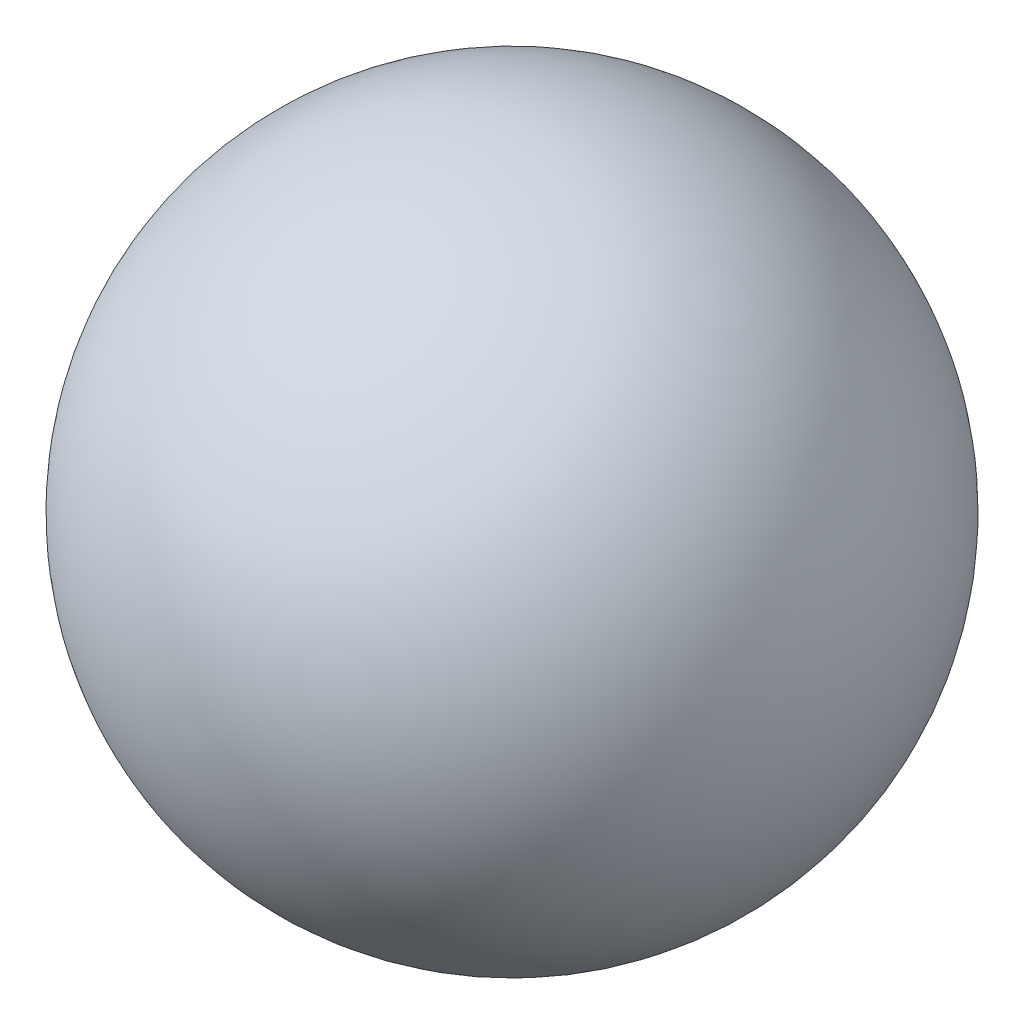
ISO-10303-21;
HEADER;
FILE_DESCRIPTION(('STEP AP214'),'2;1');
FILE_NAME('part.step','',(''),(''),'','','');
FILE_SCHEMA(('AUTOMOTIVE_DESIGN { 1 0 10303 214 1 1 1 1 }'));
ENDSEC;
DATA;
#1=APPLICATION_CONTEXT('core data for automotive mechanical design processes');
#2=APPLICATION_PROTOCOL_DEFINITION('international standard','automotive_design',2000,#1);
#3=PRODUCT_CONTEXT('',#1,'mechanical');
#4=PRODUCT('Part','Part','',(#3));
#5=PRODUCT_RELATED_PRODUCT_CATEGORY('part','',(#4));
#6=PRODUCT_DEFINITION_FORMATION('','',#4);
#7=PRODUCT_DEFINITION_CONTEXT('part definition',#1,'design');
#8=PRODUCT_DEFINITION('design','',#6,#7);
#9=PRODUCT_DEFINITION_SHAPE('','',#8);
#10=(LENGTH_UNIT() NAMED_UNIT(*) SI_UNIT(.MILLI.,.METRE.));
#11=(NAMED_UNIT(*) PLANE_ANGLE_UNIT() SI_UNIT($,.RADIAN.));
#12=(NAMED_UNIT(*) SI_UNIT($,.STERADIAN.) SOLID_ANGLE_UNIT());
#13=UNCERTAINTY_MEASURE_WITH_UNIT(LENGTH_MEASURE(1.E-05),#10,'distance_accuracy_value','');
#14=(GEOMETRIC_REPRESENTATION_CONTEXT(3) GLOBAL_UNCERTAINTY_ASSIGNED_CONTEXT((#13)) GLOBAL_UNIT_ASSIGNED_CONTEXT((#10,
#11,#12)) REPRESENTATION_CONTEXT('',''));
#15=CARTESIAN_POINT('',(0.,0.,0.));
#16=DIRECTION('',(0.,0.,1.));
#17=DIRECTION('',(1.,0.,0.));
#18=AXIS2_PLACEMENT_3D('',#15,#16,#17);
#19=CARTESIAN_POINT('',(-7.26336808809211,-2.,-9.23612386322775));
#20=DIRECTION('',(0.,0.,1.));
#21=DIRECTION('',(1.,0.,0.));
#22=AXIS2_PLACEMENT_3D('',#19,#20,#21);
#23=SPHERICAL_SURFACE('',#22,1.05);
#24=CARTESIAN_POINT('',(-7.26336808809211,-2.,-8.18612386322775));
#25=VERTEX_POINT('',#24);
#26=VERTEX_LOOP('',#25);
#27=FACE_BOUND('',#26,.T.);
#28=ADVANCED_FACE('F12',(#27),#23,.T.);
#29=CLOSED_SHELL('',(#28));
#30=MANIFOLD_SOLID_BREP('B1',#29);
#31=ADVANCED_BREP_SHAPE_REPRESENTATION('',(#18,#30),#14);
#32=SHAPE_DEFINITION_REPRESENTATION(#9,#31);
ENDSEC;
END-ISO-10303-21;
